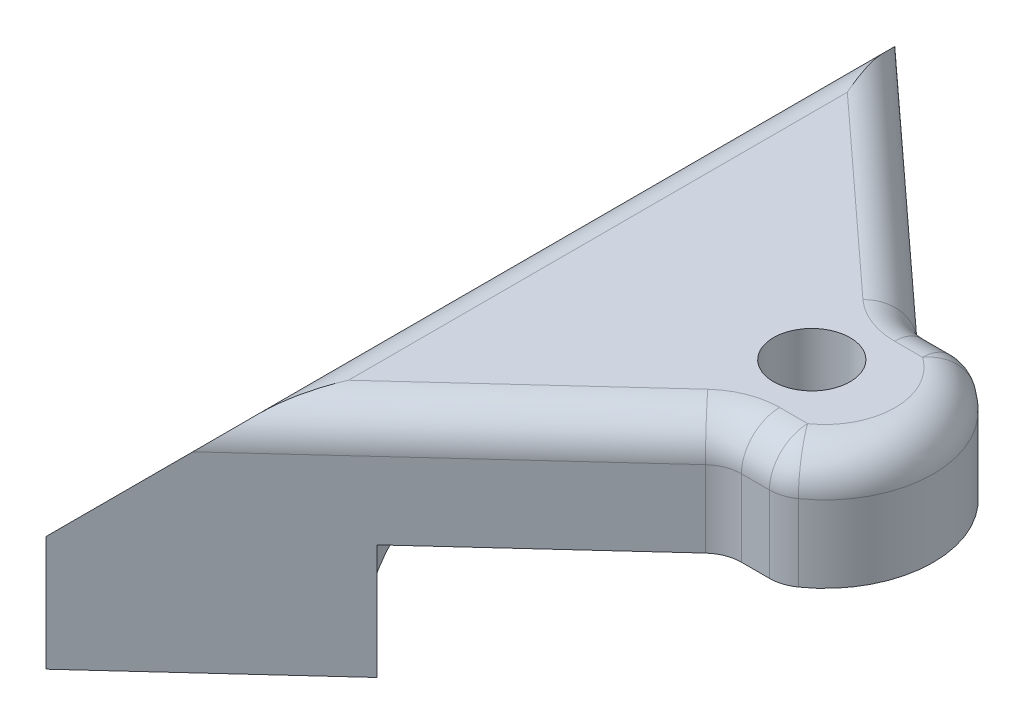
ISO-10303-21;
HEADER;
FILE_DESCRIPTION(('STEP AP214'),'2;1');
FILE_NAME('part.step','',(''),(''),'','','');
FILE_SCHEMA(('AUTOMOTIVE_DESIGN { 1 0 10303 214 1 1 1 1 }'));
ENDSEC;
DATA;
#1=APPLICATION_CONTEXT('core data for automotive mechanical design processes');
#2=APPLICATION_PROTOCOL_DEFINITION('international standard','automotive_design',2000,#1);
#3=PRODUCT_CONTEXT('',#1,'mechanical');
#4=PRODUCT('Part','Part','',(#3));
#5=PRODUCT_RELATED_PRODUCT_CATEGORY('part','',(#4));
#6=PRODUCT_DEFINITION_FORMATION('','',#4);
#7=PRODUCT_DEFINITION_CONTEXT('part definition',#1,'design');
#8=PRODUCT_DEFINITION('design','',#6,#7);
#9=PRODUCT_DEFINITION_SHAPE('','',#8);
#10=(LENGTH_UNIT() NAMED_UNIT(*) SI_UNIT(.MILLI.,.METRE.));
#11=(NAMED_UNIT(*) PLANE_ANGLE_UNIT() SI_UNIT($,.RADIAN.));
#12=(NAMED_UNIT(*) SI_UNIT($,.STERADIAN.) SOLID_ANGLE_UNIT());
#13=UNCERTAINTY_MEASURE_WITH_UNIT(LENGTH_MEASURE(1.E-05),#10,'distance_accuracy_value','');
#14=(GEOMETRIC_REPRESENTATION_CONTEXT(3) GLOBAL_UNCERTAINTY_ASSIGNED_CONTEXT((#13)) GLOBAL_UNIT_ASSIGNED_CONTEXT((#10,
#11,#12)) REPRESENTATION_CONTEXT('',''));
#15=CARTESIAN_POINT('',(0.,0.,0.));
#16=DIRECTION('',(0.,0.,1.));
#17=DIRECTION('',(1.,0.,0.));
#18=AXIS2_PLACEMENT_3D('',#15,#16,#17);
#19=CARTESIAN_POINT('',(0.,0.,0.));
#20=DIRECTION('',(0.,1.,0.));
#21=DIRECTION('',(0.,0.,1.));
#22=AXIS2_PLACEMENT_3D('',#19,#20,#21);
#23=PLANE('',#22);
#24=DIRECTION('',(1.,0.,0.));
#25=VECTOR('',#24,1.);
#26=CARTESIAN_POINT('',(0.,0.,-32.1575870971504));
#27=LINE('',#26,#25);
#28=CARTESIAN_POINT('',(9.49999999999998,0.,-32.1575870971504));
#29=VERTEX_POINT('',#28);
#30=CARTESIAN_POINT('',(30.5,0.,-32.1575870971504));
#31=VERTEX_POINT('',#30);
#32=EDGE_CURVE('E308',#29,#31,#27,.T.);
#33=ORIENTED_EDGE('',*,*,#32,.F.);
#34=DIRECTION('',(0.,0.,-1.));
#35=VECTOR('',#34,1.);
#36=CARTESIAN_POINT('',(9.49999999999998,0.,0.));
#37=LINE('',#36,#35);
#38=CARTESIAN_POINT('',(9.49999999999998,0.,-24.1575870971504));
#39=VERTEX_POINT('',#38);
#40=EDGE_CURVE('E273',#39,#29,#37,.T.);
#41=ORIENTED_EDGE('',*,*,#40,.F.);
#42=DIRECTION('',(-1.,0.,0.));
#43=VECTOR('',#42,1.);
#44=CARTESIAN_POINT('',(0.,0.,-24.1575870971504));
#45=LINE('',#44,#43);
#46=CARTESIAN_POINT('',(30.5,0.,-24.1575870971504));
#47=VERTEX_POINT('',#46);
#48=EDGE_CURVE('E282',#47,#39,#45,.T.);
#49=ORIENTED_EDGE('',*,*,#48,.F.);
#50=DIRECTION('',(0.,0.,-1.));
#51=VECTOR('',#50,1.);
#52=CARTESIAN_POINT('',(30.5,0.,0.));
#53=LINE('',#52,#51);
#54=CARTESIAN_POINT('',(30.5,0.,-19.6575870971504));
#55=VERTEX_POINT('',#54);
#56=EDGE_CURVE('E317',#55,#47,#53,.T.);
#57=ORIENTED_EDGE('',*,*,#56,.F.);
#58=DIRECTION('',(1.,0.,0.));
#59=VECTOR('',#58,1.);
#60=CARTESIAN_POINT('',(0.,0.,-19.6575870971504));
#61=LINE('',#60,#59);
#62=CARTESIAN_POINT('',(47.5,0.,-19.6575870971504));
#63=VERTEX_POINT('',#62);
#64=EDGE_CURVE('E325',#55,#63,#61,.T.);
#65=ORIENTED_EDGE('',*,*,#64,.T.);
#66=DIRECTION('',(0.,0.,-1.));
#67=VECTOR('',#66,1.);
#68=CARTESIAN_POINT('',(47.5,0.,0.));
#69=LINE('',#68,#67);
#70=CARTESIAN_POINT('',(47.5,0.,-36.6575870971504));
#71=VERTEX_POINT('',#70);
#72=EDGE_CURVE('E321',#63,#71,#69,.T.);
#73=ORIENTED_EDGE('',*,*,#72,.T.);
#74=DIRECTION('',(1.,0.,0.));
#75=VECTOR('',#74,1.);
#76=CARTESIAN_POINT('',(0.,0.,-36.6575870971504));
#77=LINE('',#76,#75);
#78=CARTESIAN_POINT('',(30.5,0.,-36.6575870971504));
#79=VERTEX_POINT('',#78);
#80=EDGE_CURVE('E316',#79,#71,#77,.T.);
#81=ORIENTED_EDGE('',*,*,#80,.F.);
#82=EDGE_CURVE('E312',#31,#79,#53,.T.);
#83=ORIENTED_EDGE('',*,*,#82,.F.);
#84=EDGE_LOOP('',(#33,#41,#49,#57,#65,#73,#81,#83));
#85=FACE_BOUND('',#84,.T.);
#86=DIRECTION('',(1.,0.,0.));
#87=VECTOR('',#86,1.);
#88=CARTESIAN_POINT('',(0.,0.,-40.6575870971504));
#89=LINE('',#88,#87);
#90=CARTESIAN_POINT('',(42.3085548164089,0.,-40.6575870971504));
#91=VERTEX_POINT('',#90);
#92=CARTESIAN_POINT('',(45.9674324639169,0.,-40.6575870971504));
#93=VERTEX_POINT('',#92);
#94=EDGE_CURVE('E360',#91,#93,#89,.T.);
#95=ORIENTED_EDGE('',*,*,#94,.T.);
#96=CARTESIAN_POINT('',(45.9674324639169,0.,-35.6575870971504));
#97=DIRECTION('',(0.,1.,0.));
#98=DIRECTION('',(0.,0.,1.));
#99=AXIS2_PLACEMENT_3D('',#96,#97,#98);
#100=CIRCLE('',#99,5.);
#101=CARTESIAN_POINT('',(48.8422303367973,0.,-39.7484961880595));
#102=VERTEX_POINT('',#101);
#103=EDGE_CURVE('E469',#93,#102,#100,.F.);
#104=ORIENTED_EDGE('',*,*,#103,.T.);
#105=CARTESIAN_POINT('',(40.6969696969696,0.,-28.1575870971504));
#106=DIRECTION('',(0.,1.,0.));
#107=DIRECTION('',(0.,0.,1.));
#108=AXIS2_PLACEMENT_3D('',#105,#106,#107);
#109=CIRCLE('',#108,14.1666666666667);
#110=CARTESIAN_POINT('',(48.8422303367973,0.,-16.5666780062413));
#111=VERTEX_POINT('',#110);
#112=EDGE_CURVE('E335',#102,#111,#109,.F.);
#113=ORIENTED_EDGE('',*,*,#112,.T.);
#114=CARTESIAN_POINT('',(45.9674324639169,0.,-20.6575870971504));
#115=DIRECTION('',(0.,1.,0.));
#116=DIRECTION('',(0.,0.,1.));
#117=AXIS2_PLACEMENT_3D('',#114,#115,#116);
#118=CIRCLE('',#117,5.);
#119=CARTESIAN_POINT('',(45.9674324639169,0.,-15.6575870971504));
#120=VERTEX_POINT('',#119);
#121=EDGE_CURVE('E466',#111,#120,#118,.F.);
#122=ORIENTED_EDGE('',*,*,#121,.T.);
#123=DIRECTION('',(-1.,0.,0.));
#124=VECTOR('',#123,1.);
#125=CARTESIAN_POINT('',(0.,0.,-15.6575870971504));
#126=LINE('',#125,#124);
#127=CARTESIAN_POINT('',(42.3085548164089,0.,-15.6575870971504));
#128=VERTEX_POINT('',#127);
#129=EDGE_CURVE('E232',#120,#128,#126,.T.);
#130=ORIENTED_EDGE('',*,*,#129,.T.);
#131=CARTESIAN_POINT('',(42.3085548164089,0.,-10.6575870971504));
#132=DIRECTION('',(0.,1.,0.));
#133=DIRECTION('',(0.,0.,1.));
#134=AXIS2_PLACEMENT_3D('',#131,#132,#133);
#135=CIRCLE('',#134,5.);
#136=CARTESIAN_POINT('',(38.9299316738222,0.,-14.3433577981541));
#137=VERTEX_POINT('',#136);
#138=EDGE_CURVE('E55',#128,#137,#135,.T.);
#139=ORIENTED_EDGE('',*,*,#138,.T.);
#140=DIRECTION('',(0.737154140200741,0.,-0.675724628517347));
#141=VECTOR('',#140,1.);
#142=CARTESIAN_POINT('',(10.6309377478345,0.,11.5973866340013));
#143=LINE('',#142,#141);
#144=CARTESIAN_POINT('',(16.5638592524006,0.,6.15887525481573));
#145=VERTEX_POINT('',#144);
#146=EDGE_CURVE('E367',#145,#137,#143,.T.);
#147=ORIENTED_EDGE('',*,*,#146,.F.);
#148=CARTESIAN_POINT('',(39.,0.,-28.1575870971504));
#149=DIRECTION('',(0.,1.,0.));
#150=DIRECTION('',(0.,0.,-1.));
#151=AXIS2_PLACEMENT_3D('',#148,#149,#150);
#152=CIRCLE('',#151,41.);
#153=CARTESIAN_POINT('',(16.5638592524006,0.,-62.4740494491165));
#154=VERTEX_POINT('',#153);
#155=EDGE_CURVE('E248',#154,#145,#152,.T.);
#156=ORIENTED_EDGE('',*,*,#155,.F.);
#157=DIRECTION('',(-0.737154140200741,0.,-0.675724628517347));
#158=VECTOR('',#157,1.);
#159=CARTESIAN_POINT('',(38.6822697993353,0.,-42.198839781093));
#160=LINE('',#159,#158);
#161=CARTESIAN_POINT('',(38.9299316738222,0.,-41.9718163961467));
#162=VERTEX_POINT('',#161);
#163=EDGE_CURVE('E364',#162,#154,#160,.T.);
#164=ORIENTED_EDGE('',*,*,#163,.F.);
#165=CARTESIAN_POINT('',(42.3085548164089,0.,-45.6575870971504));
#166=DIRECTION('',(0.,1.,0.));
#167=DIRECTION('',(0.,0.,1.));
#168=AXIS2_PLACEMENT_3D('',#165,#166,#167);
#169=CIRCLE('',#168,5.);
#170=EDGE_CURVE('E11',#162,#91,#169,.T.);
#171=ORIENTED_EDGE('',*,*,#170,.T.);
#172=EDGE_LOOP('',(#95,#104,#113,#122,#130,#139,#147,#156,#164,#171));
#173=FACE_BOUND('',#172,.T.);
#174=ADVANCED_FACE('F45',(#85,#173),#23,.F.);
#175=CARTESIAN_POINT('',(40.6969696969696,15.,-28.1575870971504));
#176=DIRECTION('',(0.,-1.,0.));
#177=DIRECTION('',(0.,0.,-1.));
#178=AXIS2_PLACEMENT_3D('',#175,#176,#177);
#179=CYLINDRICAL_SURFACE('',#178,14.1666666666667);
#180=ORIENTED_EDGE('',*,*,#112,.F.);
#181=DIRECTION('',(0.,-1.,0.));
#182=VECTOR('',#181,1.);
#183=CARTESIAN_POINT('',(48.8422303367973,15.,-39.7484961880595));
#184=LINE('',#183,#182);
#185=CARTESIAN_POINT('',(48.8422303367973,10.,-39.7484961880595));
#186=VERTEX_POINT('',#185);
#187=EDGE_CURVE('E435',#102,#186,#184,.F.);
#188=ORIENTED_EDGE('',*,*,#187,.T.);
#189=CARTESIAN_POINT('',(40.6969696969696,10.,-28.1575870971504));
#190=DIRECTION('',(0.,1.,0.));
#191=DIRECTION('',(0.,0.,1.));
#192=AXIS2_PLACEMENT_3D('',#189,#190,#191);
#193=CIRCLE('',#192,14.1666666666667);
#194=CARTESIAN_POINT('',(48.8422303367973,10.,-16.5666780062413));
#195=VERTEX_POINT('',#194);
#196=EDGE_CURVE('E432',#186,#195,#193,.F.);
#197=ORIENTED_EDGE('',*,*,#196,.T.);
#198=DIRECTION('',(0.,-1.,0.));
#199=VECTOR('',#198,1.);
#200=CARTESIAN_POINT('',(48.8422303367973,15.,-16.5666780062413));
#201=LINE('',#200,#199);
#202=EDGE_CURVE('E429',#195,#111,#201,.T.);
#203=ORIENTED_EDGE('',*,*,#202,.T.);
#204=EDGE_LOOP('',(#180,#188,#197,#203));
#205=FACE_BOUND('',#204,.T.);
#206=ADVANCED_FACE('F560',(#205),#179,.T.);
#207=CARTESIAN_POINT('',(0.,15.,-40.6575870971504));
#208=DIRECTION('',(0.,0.,-1.));
#209=DIRECTION('',(-1.,0.,0.));
#210=AXIS2_PLACEMENT_3D('',#207,#208,#209);
#211=PLANE('',#210);
#212=ORIENTED_EDGE('',*,*,#94,.F.);
#213=DIRECTION('',(0.,-1.,0.));
#214=VECTOR('',#213,1.);
#215=CARTESIAN_POINT('',(42.3085548164089,15.,-40.6575870971504));
#216=LINE('',#215,#214);
#217=CARTESIAN_POINT('',(42.3085548164089,10.,-40.6575870971504));
#218=VERTEX_POINT('',#217);
#219=EDGE_CURVE('E68',#91,#218,#216,.F.);
#220=ORIENTED_EDGE('',*,*,#219,.T.);
#221=DIRECTION('',(1.,0.,0.));
#222=VECTOR('',#221,1.);
#223=CARTESIAN_POINT('',(0.,10.,-40.6575870971504));
#224=LINE('',#223,#222);
#225=CARTESIAN_POINT('',(45.9674324639169,10.,-40.6575870971504));
#226=VERTEX_POINT('',#225);
#227=EDGE_CURVE('E63',#218,#226,#224,.T.);
#228=ORIENTED_EDGE('',*,*,#227,.T.);
#229=DIRECTION('',(0.,-1.,0.));
#230=VECTOR('',#229,1.);
#231=CARTESIAN_POINT('',(45.9674324639169,15.,-40.6575870971504));
#232=LINE('',#231,#230);
#233=EDGE_CURVE('E461',#226,#93,#232,.T.);
#234=ORIENTED_EDGE('',*,*,#233,.T.);
#235=EDGE_LOOP('',(#212,#220,#228,#234));
#236=FACE_BOUND('',#235,.T.);
#237=ADVANCED_FACE('F555',(#236),#211,.T.);
#238=CARTESIAN_POINT('',(38.6822697993353,15.,-42.198839781093));
#239=DIRECTION('',(-0.675724628517346,0.,0.737154140200741));
#240=DIRECTION('',(0.737154140200741,0.,0.675724628517347));
#241=AXIS2_PLACEMENT_3D('',#238,#239,#240);
#242=PLANE('',#241);
#243=DIRECTION('',(-0.737154140200741,0.,-0.675724628517347));
#244=VECTOR('',#243,1.);
#245=CARTESIAN_POINT('',(40.3636363636363,10.,-40.6575870971504));
#246=LINE('',#245,#244);
#247=CARTESIAN_POINT('',(4.00000000000001,10.,-73.9909204304837));
#248=VERTEX_POINT('',#247);
#249=CARTESIAN_POINT('',(38.9299316738222,10.,-41.9718163961467));
#250=VERTEX_POINT('',#249);
#251=EDGE_CURVE('E453',#248,#250,#246,.F.);
#252=ORIENTED_EDGE('',*,*,#251,.T.);
#253=DIRECTION('',(0.,-1.,0.));
#254=VECTOR('',#253,1.);
#255=CARTESIAN_POINT('',(38.9299316738222,15.,-41.9718163961467));
#256=LINE('',#255,#254);
#257=EDGE_CURVE('E456',#250,#162,#256,.T.);
#258=ORIENTED_EDGE('',*,*,#257,.T.);
#259=ORIENTED_EDGE('',*,*,#163,.T.);
#260=DIRECTION('',(0.,1.,0.));
#261=VECTOR('',#260,1.);
#262=CARTESIAN_POINT('',(16.5638592524006,-15.,-62.4740494491165));
#263=LINE('',#262,#261);
#264=CARTESIAN_POINT('',(16.5638592524006,-15.,-62.4740494491165));
#265=VERTEX_POINT('',#264);
#266=EDGE_CURVE('E264',#265,#154,#263,.T.);
#267=ORIENTED_EDGE('',*,*,#266,.F.);
#268=DIRECTION('',(0.737154140200741,0.,0.675724628517346));
#269=VECTOR('',#268,1.);
#270=CARTESIAN_POINT('',(-6.00000000000001,-15.,-83.1575870971504));
#271=LINE('',#270,#269);
#272=CARTESIAN_POINT('',(-6.00000000000001,-15.,-83.1575870971504));
#273=VERTEX_POINT('',#272);
#274=EDGE_CURVE('E241',#273,#265,#271,.T.);
#275=ORIENTED_EDGE('',*,*,#274,.F.);
#276=DIRECTION('',(0.,-1.,0.));
#277=VECTOR('',#276,1.);
#278=CARTESIAN_POINT('',(-6.00000000000001,15.,-83.1575870971504));
#279=LINE('',#278,#277);
#280=CARTESIAN_POINT('',(-6.00000000000001,0.,-83.1575870971504));
#281=VERTEX_POINT('',#280);
#282=EDGE_CURVE('E231',#281,#273,#279,.T.);
#283=ORIENTED_EDGE('',*,*,#282,.F.);
#284=DIRECTION('',(0.593361811720978,0.59336181172098,0.543914994077563));
#285=VECTOR('',#284,1.);
#286=CARTESIAN_POINT('',(31.400492657271,37.4004926572711,-48.8738021613187));
#287=LINE('',#286,#285);
#288=EDGE_CURVE('E388',#281,#248,#287,.T.);
#289=ORIENTED_EDGE('',*,*,#288,.T.);
#290=EDGE_LOOP('',(#252,#258,#259,#267,#275,#283,#289));
#291=FACE_BOUND('',#290,.T.);
#292=ADVANCED_FACE('F546',(#291),#242,.F.);
#293=CARTESIAN_POINT('',(-6.,15.,0.));
#294=DIRECTION('',(1.,0.,0.));
#295=DIRECTION('',(0.,0.,-1.));
#296=AXIS2_PLACEMENT_3D('',#293,#294,#295);
#297=PLANE('',#296);
#298=CARTESIAN_POINT('',(-6.,-8.,-3.15758709715041));
#299=DIRECTION('',(1.,0.,0.));
#300=DIRECTION('',(0.,0.,-1.));
#301=AXIS2_PLACEMENT_3D('',#298,#299,#300);
#302=CIRCLE('',#301,3.5);
#303=CARTESIAN_POINT('',(-6.,-8.,-6.65758709715041));
#304=VERTEX_POINT('',#303);
#305=EDGE_CURVE('E379',#304,#304,#302,.F.);
#306=ORIENTED_EDGE('',*,*,#305,.F.);
#307=EDGE_LOOP('',(#306));
#308=FACE_BOUND('',#307,.T.);
#309=CARTESIAN_POINT('',(-6.00000000000001,-8.,-53.1575870971504));
#310=DIRECTION('',(1.,0.,0.));
#311=DIRECTION('',(0.,0.,-1.));
#312=AXIS2_PLACEMENT_3D('',#309,#310,#311);
#313=CIRCLE('',#312,3.5);
#314=CARTESIAN_POINT('',(-6.00000000000001,-8.,-56.6575870971504));
#315=VERTEX_POINT('',#314);
#316=EDGE_CURVE('E375',#315,#315,#313,.F.);
#317=ORIENTED_EDGE('',*,*,#316,.F.);
#318=EDGE_LOOP('',(#317));
#319=FACE_BOUND('',#318,.T.);
#320=DIRECTION('',(0.,-1.,0.));
#321=VECTOR('',#320,1.);
#322=CARTESIAN_POINT('',(-6.,15.,26.8424129028496));
#323=LINE('',#322,#321);
#324=CARTESIAN_POINT('',(-6.,0.,26.8424129028496));
#325=VERTEX_POINT('',#324);
#326=CARTESIAN_POINT('',(-6.,-15.,26.8424129028496));
#327=VERTEX_POINT('',#326);
#328=EDGE_CURVE('E219',#325,#327,#323,.T.);
#329=ORIENTED_EDGE('',*,*,#328,.F.);
#330=DIRECTION('',(0.,0.,-1.));
#331=VECTOR('',#330,1.);
#332=CARTESIAN_POINT('',(-6.00000000000001,0.,-83.1575870971504));
#333=LINE('',#332,#331);
#334=EDGE_CURVE('E385',#325,#281,#333,.T.);
#335=ORIENTED_EDGE('',*,*,#334,.T.);
#336=ORIENTED_EDGE('',*,*,#282,.T.);
#337=DIRECTION('',(0.,0.,-1.));
#338=VECTOR('',#337,1.);
#339=CARTESIAN_POINT('',(-6.,-15.,26.8424129028496));
#340=LINE('',#339,#338);
#341=EDGE_CURVE('E235',#327,#273,#340,.T.);
#342=ORIENTED_EDGE('',*,*,#341,.F.);
#343=EDGE_LOOP('',(#329,#335,#336,#342));
#344=FACE_BOUND('',#343,.T.);
#345=ADVANCED_FACE('F236',(#308,#319,#344),#297,.F.);
#346=CARTESIAN_POINT('',(10.6309377478345,15.,11.5973866340013));
#347=DIRECTION('',(-0.675724628517347,0.,-0.737154140200741));
#348=DIRECTION('',(-0.737154140200741,0.,0.675724628517347));
#349=AXIS2_PLACEMENT_3D('',#346,#347,#348);
#350=PLANE('',#349);
#351=ORIENTED_EDGE('',*,*,#146,.T.);
#352=DIRECTION('',(0.,-1.,0.));
#353=VECTOR('',#352,1.);
#354=CARTESIAN_POINT('',(38.9299316738222,15.,-14.3433577981541));
#355=LINE('',#354,#353);
#356=CARTESIAN_POINT('',(38.9299316738222,10.,-14.3433577981541));
#357=VERTEX_POINT('',#356);
#358=EDGE_CURVE('E450',#137,#357,#355,.F.);
#359=ORIENTED_EDGE('',*,*,#358,.T.);
#360=DIRECTION('',(0.737154140200741,0.,-0.675724628517347));
#361=VECTOR('',#360,1.);
#362=CARTESIAN_POINT('',(9.,10.,13.0924129028496));
#363=LINE('',#362,#361);
#364=CARTESIAN_POINT('',(4.00000000000001,10.,17.6757462361829));
#365=VERTEX_POINT('',#364);
#366=EDGE_CURVE('E447',#357,#365,#363,.F.);
#367=ORIENTED_EDGE('',*,*,#366,.T.);
#368=DIRECTION('',(-0.593361811720978,-0.59336181172098,0.543914994077563));
#369=VECTOR('',#368,1.);
#370=CARTESIAN_POINT('',(13.2254242131446,19.2254242131446,9.2191073741337));
#371=LINE('',#370,#369);
#372=EDGE_CURVE('E227',#365,#325,#371,.T.);
#373=ORIENTED_EDGE('',*,*,#372,.T.);
#374=ORIENTED_EDGE('',*,*,#328,.T.);
#375=DIRECTION('',(-0.737154140200741,0.,0.675724628517346));
#376=VECTOR('',#375,1.);
#377=CARTESIAN_POINT('',(-6.,-15.,26.8424129028496));
#378=LINE('',#377,#376);
#379=CARTESIAN_POINT('',(16.5638592524006,-15.,6.15887525481573));
#380=VERTEX_POINT('',#379);
#381=EDGE_CURVE('E225',#380,#327,#378,.T.);
#382=ORIENTED_EDGE('',*,*,#381,.F.);
#383=DIRECTION('',(0.,1.,0.));
#384=VECTOR('',#383,1.);
#385=CARTESIAN_POINT('',(16.5638592524006,-15.,6.15887525481573));
#386=LINE('',#385,#384);
#387=EDGE_CURVE('E260',#380,#145,#386,.T.);
#388=ORIENTED_EDGE('',*,*,#387,.T.);
#389=EDGE_LOOP('',(#351,#359,#367,#373,#374,#382,#388));
#390=FACE_BOUND('',#389,.T.);
#391=ADVANCED_FACE('F222',(#390),#350,.F.);
#392=CARTESIAN_POINT('',(0.,15.,-15.6575870971504));
#393=DIRECTION('',(0.,0.,1.));
#394=DIRECTION('',(1.,0.,0.));
#395=AXIS2_PLACEMENT_3D('',#392,#393,#394);
#396=PLANE('',#395);
#397=DIRECTION('',(-1.,0.,0.));
#398=VECTOR('',#397,1.);
#399=CARTESIAN_POINT('',(0.,10.,-15.6575870971504));
#400=LINE('',#399,#398);
#401=CARTESIAN_POINT('',(45.9674324639169,10.,-15.6575870971504));
#402=VERTEX_POINT('',#401);
#403=CARTESIAN_POINT('',(42.3085548164089,10.,-15.6575870971504));
#404=VERTEX_POINT('',#403);
#405=EDGE_CURVE('E438',#402,#404,#400,.T.);
#406=ORIENTED_EDGE('',*,*,#405,.T.);
#407=DIRECTION('',(0.,-1.,0.));
#408=VECTOR('',#407,1.);
#409=CARTESIAN_POINT('',(42.3085548164089,15.,-15.6575870971504));
#410=LINE('',#409,#408);
#411=EDGE_CURVE('E444',#404,#128,#410,.T.);
#412=ORIENTED_EDGE('',*,*,#411,.T.);
#413=ORIENTED_EDGE('',*,*,#129,.F.);
#414=DIRECTION('',(0.,-1.,0.));
#415=VECTOR('',#414,1.);
#416=CARTESIAN_POINT('',(45.9674324639169,15.,-15.6575870971504));
#417=LINE('',#416,#415);
#418=EDGE_CURVE('E441',#120,#402,#417,.F.);
#419=ORIENTED_EDGE('',*,*,#418,.T.);
#420=EDGE_LOOP('',(#406,#412,#413,#419));
#421=FACE_BOUND('',#420,.T.);
#422=ADVANCED_FACE('F553',(#421),#396,.T.);
#423=CARTESIAN_POINT('',(0.,15.,0.));
#424=DIRECTION('',(0.,1.,0.));
#425=DIRECTION('',(0.,0.,1.));
#426=AXIS2_PLACEMENT_3D('',#423,#424,#425);
#427=PLANE('',#426);
#428=CARTESIAN_POINT('',(40.6969696969696,15.,-28.1575870971504));
#429=DIRECTION('',(0.,1.,0.));
#430=DIRECTION('',(0.,0.,1.));
#431=AXIS2_PLACEMENT_3D('',#428,#429,#430);
#432=CIRCLE('',#431,9.16666666666668);
#433=CARTESIAN_POINT('',(45.9674324639169,15.,-20.6575870971504));
#434=VERTEX_POINT('',#433);
#435=CARTESIAN_POINT('',(45.9674324639169,15.,-35.6575870971504));
#436=VERTEX_POINT('',#435);
#437=EDGE_CURVE('E402',#434,#436,#432,.T.);
#438=ORIENTED_EDGE('',*,*,#437,.T.);
#439=DIRECTION('',(1.,0.,0.));
#440=VECTOR('',#439,1.);
#441=CARTESIAN_POINT('',(0.,15.,-35.6575870971504));
#442=LINE('',#441,#440);
#443=CARTESIAN_POINT('',(42.3085548164089,15.,-35.6575870971504));
#444=VERTEX_POINT('',#443);
#445=EDGE_CURVE('E416',#436,#444,#442,.F.);
#446=ORIENTED_EDGE('',*,*,#445,.T.);
#447=CARTESIAN_POINT('',(42.3085548164089,15.,-45.6575870971504));
#448=DIRECTION('',(0.,1.,0.));
#449=DIRECTION('',(0.,0.,1.));
#450=AXIS2_PLACEMENT_3D('',#447,#448,#449);
#451=CIRCLE('',#450,10.);
#452=CARTESIAN_POINT('',(35.5513085312354,15.,-38.286045695143));
#453=VERTEX_POINT('',#452);
#454=EDGE_CURVE('E412',#453,#444,#451,.T.);
#455=ORIENTED_EDGE('',*,*,#454,.F.);
#456=DIRECTION('',(-0.737154140200741,0.,-0.675724628517347));
#457=VECTOR('',#456,1.);
#458=CARTESIAN_POINT('',(5.62137685741324,15.,-65.7218163961467));
#459=LINE('',#458,#457);
#460=CARTESIAN_POINT('',(11.0710678118655,15.,-60.7262663545655));
#461=VERTEX_POINT('',#460);
#462=EDGE_CURVE('E409',#453,#461,#459,.T.);
#463=ORIENTED_EDGE('',*,*,#462,.T.);
#464=DIRECTION('',(0.,0.,1.));
#465=VECTOR('',#464,1.);
#466=CARTESIAN_POINT('',(11.0710678118655,15.,0.));
#467=LINE('',#466,#465);
#468=CARTESIAN_POINT('',(11.0710678118655,15.,4.41109216026468));
#469=VERTEX_POINT('',#468);
#470=EDGE_CURVE('E405',#461,#469,#467,.T.);
#471=ORIENTED_EDGE('',*,*,#470,.T.);
#472=DIRECTION('',(0.737154140200741,0.,-0.675724628517347));
#473=VECTOR('',#472,1.);
#474=CARTESIAN_POINT('',(36.9850132210496,15.,-19.3433577981541));
#475=LINE('',#474,#473);
#476=CARTESIAN_POINT('',(35.5513085312354,15.,-18.0291284991578));
#477=VERTEX_POINT('',#476);
#478=EDGE_CURVE('E396',#469,#477,#475,.T.);
#479=ORIENTED_EDGE('',*,*,#478,.T.);
#480=CARTESIAN_POINT('',(42.3085548164089,15.,-10.6575870971504));
#481=DIRECTION('',(0.,1.,0.));
#482=DIRECTION('',(0.,0.,1.));
#483=AXIS2_PLACEMENT_3D('',#480,#481,#482);
#484=CIRCLE('',#483,10.);
#485=CARTESIAN_POINT('',(42.3085548164089,15.,-20.6575870971504));
#486=VERTEX_POINT('',#485);
#487=EDGE_CURVE('E392',#486,#477,#484,.T.);
#488=ORIENTED_EDGE('',*,*,#487,.F.);
#489=DIRECTION('',(-1.,0.,0.));
#490=VECTOR('',#489,1.);
#491=CARTESIAN_POINT('',(0.,15.,-20.6575870971504));
#492=LINE('',#491,#490);
#493=EDGE_CURVE('E399',#486,#434,#492,.F.);
#494=ORIENTED_EDGE('',*,*,#493,.T.);
#495=EDGE_LOOP('',(#438,#446,#455,#463,#471,#479,#488,#494));
#496=FACE_BOUND('',#495,.T.);
#497=CARTESIAN_POINT('',(39.,15.,-28.1575870971504));
#498=DIRECTION('',(0.,1.,0.));
#499=DIRECTION('',(0.,0.,1.));
#500=AXIS2_PLACEMENT_3D('',#497,#498,#499);
#501=CIRCLE('',#500,4.99999999999999);
#502=CARTESIAN_POINT('',(39.,15.,-23.1575870971504));
#503=VERTEX_POINT('',#502);
#504=EDGE_CURVE('E269',#503,#503,#501,.T.);
#505=ORIENTED_EDGE('',*,*,#504,.F.);
#506=EDGE_LOOP('',(#505));
#507=FACE_BOUND('',#506,.T.);
#508=ADVANCED_FACE('F572',(#496,#507),#427,.T.);
#509=CARTESIAN_POINT('',(9.49999999999998,6.,0.));
#510=DIRECTION('',(-1.,0.,0.));
#511=DIRECTION('',(0.,0.,1.));
#512=AXIS2_PLACEMENT_3D('',#509,#510,#511);
#513=PLANE('',#512);
#514=ORIENTED_EDGE('',*,*,#40,.T.);
#515=DIRECTION('',(0.,-1.,0.));
#516=VECTOR('',#515,1.);
#517=CARTESIAN_POINT('',(9.49999999999998,6.,-32.1575870971504));
#518=LINE('',#517,#516);
#519=CARTESIAN_POINT('',(9.49999999999998,6.,-32.1575870971504));
#520=VERTEX_POINT('',#519);
#521=EDGE_CURVE('E305',#520,#29,#518,.T.);
#522=ORIENTED_EDGE('',*,*,#521,.F.);
#523=DIRECTION('',(0.,0.,-1.));
#524=VECTOR('',#523,1.);
#525=CARTESIAN_POINT('',(9.49999999999998,6.,0.));
#526=LINE('',#525,#524);
#527=CARTESIAN_POINT('',(9.49999999999998,6.,-24.1575870971504));
#528=VERTEX_POINT('',#527);
#529=EDGE_CURVE('E277',#528,#520,#526,.T.);
#530=ORIENTED_EDGE('',*,*,#529,.F.);
#531=DIRECTION('',(0.,-1.,0.));
#532=VECTOR('',#531,1.);
#533=CARTESIAN_POINT('',(9.49999999999998,6.,-24.1575870971504));
#534=LINE('',#533,#532);
#535=EDGE_CURVE('E332',#528,#39,#534,.T.);
#536=ORIENTED_EDGE('',*,*,#535,.T.);
#537=EDGE_LOOP('',(#514,#522,#530,#536));
#538=FACE_BOUND('',#537,.T.);
#539=ADVANCED_FACE('F579',(#538),#513,.F.);
#540=CARTESIAN_POINT('',(0.,6.,-24.1575870971504));
#541=DIRECTION('',(0.,0.,1.));
#542=DIRECTION('',(1.,0.,0.));
#543=AXIS2_PLACEMENT_3D('',#540,#541,#542);
#544=PLANE('',#543);
#545=ORIENTED_EDGE('',*,*,#48,.T.);
#546=ORIENTED_EDGE('',*,*,#535,.F.);
#547=DIRECTION('',(-1.,0.,0.));
#548=VECTOR('',#547,1.);
#549=CARTESIAN_POINT('',(0.,6.,-24.1575870971504));
#550=LINE('',#549,#548);
#551=CARTESIAN_POINT('',(30.5,6.,-24.1575870971504));
#552=VERTEX_POINT('',#551);
#553=EDGE_CURVE('E301',#552,#528,#550,.T.);
#554=ORIENTED_EDGE('',*,*,#553,.F.);
#555=DIRECTION('',(0.,-1.,0.));
#556=VECTOR('',#555,1.);
#557=CARTESIAN_POINT('',(30.5,6.,-24.1575870971504));
#558=LINE('',#557,#556);
#559=EDGE_CURVE('E336',#552,#47,#558,.T.);
#560=ORIENTED_EDGE('',*,*,#559,.T.);
#561=EDGE_LOOP('',(#545,#546,#554,#560));
#562=FACE_BOUND('',#561,.T.);
#563=ADVANCED_FACE('F940',(#562),#544,.F.);
#564=CARTESIAN_POINT('',(30.5,6.,0.));
#565=DIRECTION('',(-1.,0.,0.));
#566=DIRECTION('',(0.,0.,1.));
#567=AXIS2_PLACEMENT_3D('',#564,#565,#566);
#568=PLANE('',#567);
#569=ORIENTED_EDGE('',*,*,#56,.T.);
#570=ORIENTED_EDGE('',*,*,#559,.F.);
#571=DIRECTION('',(0.,0.,-1.));
#572=VECTOR('',#571,1.);
#573=CARTESIAN_POINT('',(30.5,6.,0.));
#574=LINE('',#573,#572);
#575=CARTESIAN_POINT('',(30.5,6.,-19.6575870971504));
#576=VERTEX_POINT('',#575);
#577=EDGE_CURVE('E291',#576,#552,#574,.T.);
#578=ORIENTED_EDGE('',*,*,#577,.F.);
#579=DIRECTION('',(0.,-1.,0.));
#580=VECTOR('',#579,1.);
#581=CARTESIAN_POINT('',(30.5,6.,-19.6575870971504));
#582=LINE('',#581,#580);
#583=EDGE_CURVE('E339',#576,#55,#582,.T.);
#584=ORIENTED_EDGE('',*,*,#583,.T.);
#585=EDGE_LOOP('',(#569,#570,#578,#584));
#586=FACE_BOUND('',#585,.T.);
#587=ADVANCED_FACE('F903',(#586),#568,.F.);
#588=CARTESIAN_POINT('',(0.,6.,-19.6575870971504));
#589=DIRECTION('',(0.,0.,-1.));
#590=DIRECTION('',(-1.,0.,0.));
#591=AXIS2_PLACEMENT_3D('',#588,#589,#590);
#592=PLANE('',#591);
#593=ORIENTED_EDGE('',*,*,#64,.F.);
#594=ORIENTED_EDGE('',*,*,#583,.F.);
#595=DIRECTION('',(1.,0.,0.));
#596=VECTOR('',#595,1.);
#597=CARTESIAN_POINT('',(0.,6.,-19.6575870971504));
#598=LINE('',#597,#596);
#599=CARTESIAN_POINT('',(47.5,6.,-19.6575870971504));
#600=VERTEX_POINT('',#599);
#601=EDGE_CURVE('E298',#576,#600,#598,.T.);
#602=ORIENTED_EDGE('',*,*,#601,.T.);
#603=DIRECTION('',(0.,-1.,0.));
#604=VECTOR('',#603,1.);
#605=CARTESIAN_POINT('',(47.5,6.,-19.6575870971504));
#606=LINE('',#605,#604);
#607=EDGE_CURVE('E342',#600,#63,#606,.T.);
#608=ORIENTED_EDGE('',*,*,#607,.T.);
#609=EDGE_LOOP('',(#593,#594,#602,#608));
#610=FACE_BOUND('',#609,.T.);
#611=ADVANCED_FACE('F921',(#610),#592,.T.);
#612=CARTESIAN_POINT('',(47.5,6.,0.));
#613=DIRECTION('',(-1.,0.,0.));
#614=DIRECTION('',(0.,0.,1.));
#615=AXIS2_PLACEMENT_3D('',#612,#613,#614);
#616=PLANE('',#615);
#617=ORIENTED_EDGE('',*,*,#72,.F.);
#618=ORIENTED_EDGE('',*,*,#607,.F.);
#619=DIRECTION('',(0.,0.,-1.));
#620=VECTOR('',#619,1.);
#621=CARTESIAN_POINT('',(47.5,6.,0.));
#622=LINE('',#621,#620);
#623=CARTESIAN_POINT('',(47.5,6.,-36.6575870971504));
#624=VERTEX_POINT('',#623);
#625=EDGE_CURVE('E295',#600,#624,#622,.T.);
#626=ORIENTED_EDGE('',*,*,#625,.T.);
#627=DIRECTION('',(0.,-1.,0.));
#628=VECTOR('',#627,1.);
#629=CARTESIAN_POINT('',(47.5,6.,-36.6575870971504));
#630=LINE('',#629,#628);
#631=EDGE_CURVE('E345',#624,#71,#630,.T.);
#632=ORIENTED_EDGE('',*,*,#631,.T.);
#633=EDGE_LOOP('',(#617,#618,#626,#632));
#634=FACE_BOUND('',#633,.T.);
#635=ADVANCED_FACE('F911',(#634),#616,.T.);
#636=CARTESIAN_POINT('',(0.,6.,-36.6575870971504));
#637=DIRECTION('',(0.,0.,-1.));
#638=DIRECTION('',(-1.,0.,0.));
#639=AXIS2_PLACEMENT_3D('',#636,#637,#638);
#640=PLANE('',#639);
#641=ORIENTED_EDGE('',*,*,#80,.T.);
#642=ORIENTED_EDGE('',*,*,#631,.F.);
#643=DIRECTION('',(1.,0.,0.));
#644=VECTOR('',#643,1.);
#645=CARTESIAN_POINT('',(0.,6.,-36.6575870971504));
#646=LINE('',#645,#644);
#647=CARTESIAN_POINT('',(30.5,6.,-36.6575870971504));
#648=VERTEX_POINT('',#647);
#649=EDGE_CURVE('E290',#648,#624,#646,.T.);
#650=ORIENTED_EDGE('',*,*,#649,.F.);
#651=DIRECTION('',(0.,-1.,0.));
#652=VECTOR('',#651,1.);
#653=CARTESIAN_POINT('',(30.5,6.,-36.6575870971504));
#654=LINE('',#653,#652);
#655=EDGE_CURVE('E348',#648,#79,#654,.T.);
#656=ORIENTED_EDGE('',*,*,#655,.T.);
#657=EDGE_LOOP('',(#641,#642,#650,#656));
#658=FACE_BOUND('',#657,.T.);
#659=ADVANCED_FACE('F900',(#658),#640,.F.);
#660=ORIENTED_EDGE('',*,*,#82,.T.);
#661=ORIENTED_EDGE('',*,*,#655,.F.);
#662=CARTESIAN_POINT('',(30.5,6.,-32.1575870971504));
#663=VERTEX_POINT('',#662);
#664=EDGE_CURVE('E286',#663,#648,#574,.T.);
#665=ORIENTED_EDGE('',*,*,#664,.F.);
#666=DIRECTION('',(0.,-1.,0.));
#667=VECTOR('',#666,1.);
#668=CARTESIAN_POINT('',(30.5,6.,-32.1575870971504));
#669=LINE('',#668,#667);
#670=EDGE_CURVE('E351',#663,#31,#669,.T.);
#671=ORIENTED_EDGE('',*,*,#670,.T.);
#672=EDGE_LOOP('',(#660,#661,#665,#671));
#673=FACE_BOUND('',#672,.T.);
#674=ADVANCED_FACE('F889',(#673),#568,.F.);
#675=CARTESIAN_POINT('',(0.,6.,-32.1575870971504));
#676=DIRECTION('',(0.,0.,-1.));
#677=DIRECTION('',(-1.,0.,0.));
#678=AXIS2_PLACEMENT_3D('',#675,#676,#677);
#679=PLANE('',#678);
#680=ORIENTED_EDGE('',*,*,#32,.T.);
#681=ORIENTED_EDGE('',*,*,#670,.F.);
#682=DIRECTION('',(1.,0.,0.));
#683=VECTOR('',#682,1.);
#684=CARTESIAN_POINT('',(0.,6.,-32.1575870971504));
#685=LINE('',#684,#683);
#686=EDGE_CURVE('E281',#520,#663,#685,.T.);
#687=ORIENTED_EDGE('',*,*,#686,.F.);
#688=ORIENTED_EDGE('',*,*,#521,.T.);
#689=EDGE_LOOP('',(#680,#681,#687,#688));
#690=FACE_BOUND('',#689,.T.);
#691=ADVANCED_FACE('F876',(#690),#679,.F.);
#692=CARTESIAN_POINT('',(0.,6.,0.));
#693=DIRECTION('',(0.,-1.,0.));
#694=DIRECTION('',(0.,0.,-1.));
#695=AXIS2_PLACEMENT_3D('',#692,#693,#694);
#696=PLANE('',#695);
#697=CARTESIAN_POINT('',(39.,6.,-28.1575870971504));
#698=DIRECTION('',(0.,1.,0.));
#699=DIRECTION('',(0.,0.,1.));
#700=AXIS2_PLACEMENT_3D('',#697,#698,#699);
#701=CIRCLE('',#700,4.99999999999999);
#702=CARTESIAN_POINT('',(39.,6.,-23.1575870971504));
#703=VERTEX_POINT('',#702);
#704=EDGE_CURVE('E268',#703,#703,#701,.T.);
#705=ORIENTED_EDGE('',*,*,#704,.T.);
#706=EDGE_LOOP('',(#705));
#707=FACE_BOUND('',#706,.T.);
#708=ORIENTED_EDGE('',*,*,#529,.T.);
#709=ORIENTED_EDGE('',*,*,#686,.T.);
#710=ORIENTED_EDGE('',*,*,#664,.T.);
#711=ORIENTED_EDGE('',*,*,#649,.T.);
#712=ORIENTED_EDGE('',*,*,#625,.F.);
#713=ORIENTED_EDGE('',*,*,#601,.F.);
#714=ORIENTED_EDGE('',*,*,#577,.T.);
#715=ORIENTED_EDGE('',*,*,#553,.T.);
#716=EDGE_LOOP('',(#708,#709,#710,#711,#712,#713,#714,#715));
#717=FACE_BOUND('',#716,.T.);
#718=ADVANCED_FACE('F867',(#707,#717),#696,.T.);
#719=CARTESIAN_POINT('',(39.,15.,-28.1575870971504));
#720=DIRECTION('',(0.,-1.,0.));
#721=DIRECTION('',(0.,0.,-1.));
#722=AXIS2_PLACEMENT_3D('',#719,#720,#721);
#723=CYLINDRICAL_SURFACE('',#722,4.99999999999999);
#724=ORIENTED_EDGE('',*,*,#504,.T.);
#725=EDGE_LOOP('',(#724));
#726=FACE_BOUND('',#725,.T.);
#727=ORIENTED_EDGE('',*,*,#704,.F.);
#728=EDGE_LOOP('',(#727));
#729=FACE_BOUND('',#728,.T.);
#730=ADVANCED_FACE('F818',(#726,#729),#723,.F.);
#731=CARTESIAN_POINT('',(39.,-15.,-28.1575870971504));
#732=DIRECTION('',(0.,1.,0.));
#733=DIRECTION('',(0.,0.,1.));
#734=AXIS2_PLACEMENT_3D('',#731,#732,#733);
#735=CYLINDRICAL_SURFACE('',#734,41.);
#736=ORIENTED_EDGE('',*,*,#155,.T.);
#737=ORIENTED_EDGE('',*,*,#387,.F.);
#738=CARTESIAN_POINT('',(39.,-15.,-28.1575870971504));
#739=DIRECTION('',(0.,1.,0.));
#740=DIRECTION('',(0.,0.,-1.));
#741=AXIS2_PLACEMENT_3D('',#738,#739,#740);
#742=CIRCLE('',#741,41.);
#743=EDGE_CURVE('E245',#265,#380,#742,.T.);
#744=ORIENTED_EDGE('',*,*,#743,.F.);
#745=ORIENTED_EDGE('',*,*,#266,.T.);
#746=EDGE_LOOP('',(#736,#737,#744,#745));
#747=FACE_BOUND('',#746,.T.);
#748=ADVANCED_FACE('F613',(#747),#735,.F.);
#749=CARTESIAN_POINT('',(39.,-15.,-28.1575870971504));
#750=DIRECTION('',(0.,-1.,0.));
#751=DIRECTION('',(0.,0.,-1.));
#752=AXIS2_PLACEMENT_3D('',#749,#750,#751);
#753=PLANE('',#752);
#754=ORIENTED_EDGE('',*,*,#381,.T.);
#755=ORIENTED_EDGE('',*,*,#341,.T.);
#756=ORIENTED_EDGE('',*,*,#274,.T.);
#757=ORIENTED_EDGE('',*,*,#743,.T.);
#758=EDGE_LOOP('',(#754,#755,#756,#757));
#759=FACE_BOUND('',#758,.T.);
#760=ADVANCED_FACE('F243',(#759),#753,.T.);
#761=CARTESIAN_POINT('',(-10.,-8.,-53.1575870971504));
#762=DIRECTION('',(1.,0.,0.));
#763=DIRECTION('',(0.,0.,-1.));
#764=AXIS2_PLACEMENT_3D('',#761,#762,#763);
#765=CYLINDRICAL_SURFACE('',#764,3.5);
#766=CARTESIAN_POINT('',(-10.,-8.,-53.1575870971504));
#767=DIRECTION('',(-1.,0.,0.));
#768=DIRECTION('',(0.,0.,1.));
#769=AXIS2_PLACEMENT_3D('',#766,#767,#768);
#770=CIRCLE('',#769,3.5);
#771=CARTESIAN_POINT('',(-10.,-8.,-49.6575870971504));
#772=VERTEX_POINT('',#771);
#773=EDGE_CURVE('E252',#772,#772,#770,.T.);
#774=ORIENTED_EDGE('',*,*,#773,.F.);
#775=EDGE_LOOP('',(#774));
#776=FACE_BOUND('',#775,.T.);
#777=ORIENTED_EDGE('',*,*,#316,.T.);
#778=EDGE_LOOP('',(#777));
#779=FACE_BOUND('',#778,.T.);
#780=ADVANCED_FACE('F539',(#776,#779),#765,.T.);
#781=CARTESIAN_POINT('',(-10.,-8.,-53.1575870971504));
#782=DIRECTION('',(-1.,0.,0.));
#783=DIRECTION('',(0.,0.,1.));
#784=AXIS2_PLACEMENT_3D('',#781,#782,#783);
#785=PLANE('',#784);
#786=ORIENTED_EDGE('',*,*,#773,.T.);
#787=EDGE_LOOP('',(#786));
#788=FACE_BOUND('',#787,.T.);
#789=ADVANCED_FACE('F537',(#788),#785,.T.);
#790=CARTESIAN_POINT('',(-10.,-8.,-3.15758709715041));
#791=DIRECTION('',(1.,0.,0.));
#792=DIRECTION('',(0.,0.,-1.));
#793=AXIS2_PLACEMENT_3D('',#790,#791,#792);
#794=CYLINDRICAL_SURFACE('',#793,3.5);
#795=CARTESIAN_POINT('',(-10.,-8.,-3.15758709715041));
#796=DIRECTION('',(-1.,0.,0.));
#797=DIRECTION('',(0.,0.,1.));
#798=AXIS2_PLACEMENT_3D('',#795,#796,#797);
#799=CIRCLE('',#798,3.5);
#800=CARTESIAN_POINT('',(-10.,-8.,0.34241290284959));
#801=VERTEX_POINT('',#800);
#802=EDGE_CURVE('E527',#801,#801,#799,.T.);
#803=ORIENTED_EDGE('',*,*,#802,.F.);
#804=EDGE_LOOP('',(#803));
#805=FACE_BOUND('',#804,.T.);
#806=ORIENTED_EDGE('',*,*,#305,.T.);
#807=EDGE_LOOP('',(#806));
#808=FACE_BOUND('',#807,.T.);
#809=ADVANCED_FACE('F783',(#805,#808),#794,.T.);
#810=CARTESIAN_POINT('',(-10.,-8.,-3.15758709715041));
#811=DIRECTION('',(-1.,0.,0.));
#812=DIRECTION('',(0.,0.,1.));
#813=AXIS2_PLACEMENT_3D('',#810,#811,#812);
#814=PLANE('',#813);
#815=ORIENTED_EDGE('',*,*,#802,.T.);
#816=EDGE_LOOP('',(#815));
#817=FACE_BOUND('',#816,.T.);
#818=ADVANCED_FACE('F665',(#817),#814,.T.);
#819=CARTESIAN_POINT('',(8.99999999999999,15.,0.));
#820=DIRECTION('',(-0.707106781186549,0.707106781186546,0.));
#821=DIRECTION('',(0.,0.,-1.));
#822=AXIS2_PLACEMENT_3D('',#819,#820,#821);
#823=PLANE('',#822);
#824=DIRECTION('',(0.,0.,1.));
#825=VECTOR('',#824,1.);
#826=CARTESIAN_POINT('',(7.53553390593273,13.5355339059327,0.));
#827=LINE('',#826,#825);
#828=CARTESIAN_POINT('',(7.53553390593273,13.5355339059327,12.4481917545453));
#829=VERTEX_POINT('',#828);
#830=CARTESIAN_POINT('',(7.53553390593272,13.5355339059327,-68.7633659488461));
#831=VERTEX_POINT('',#830);
#832=EDGE_CURVE('E422',#829,#831,#827,.F.);
#833=ORIENTED_EDGE('',*,*,#832,.T.);
#834=CARTESIAN_POINT('',(4.,10.,-67.2080785154422));
#835=DIRECTION('',(-0.707106781186549,0.707106781186546,0.));
#836=DIRECTION('',(0.431889450449215,0.431889450449217,0.791797325823565));
#837=AXIS2_PLACEMENT_3D('',#834,#835,#836);
#838=ELLIPSE('',#837,9.59238702768443,5.);
#839=EDGE_CURVE('E426',#831,#248,#838,.T.);
#840=ORIENTED_EDGE('',*,*,#839,.T.);
#841=ORIENTED_EDGE('',*,*,#288,.F.);
#842=ORIENTED_EDGE('',*,*,#334,.F.);
#843=ORIENTED_EDGE('',*,*,#372,.F.);
#844=CARTESIAN_POINT('',(4.00000000000001,10.,10.8929043211414));
#845=DIRECTION('',(-0.707106781186549,0.707106781186546,0.));
#846=DIRECTION('',(-0.431889450449215,-0.431889450449217,0.791797325823565));
#847=AXIS2_PLACEMENT_3D('',#844,#845,#846);
#848=ELLIPSE('',#847,9.59238702768443,5.);
#849=EDGE_CURVE('E419',#365,#829,#848,.T.);
#850=ORIENTED_EDGE('',*,*,#849,.T.);
#851=EDGE_LOOP('',(#833,#840,#841,#842,#843,#850));
#852=FACE_BOUND('',#851,.T.);
#853=ADVANCED_FACE('F605',(#852),#823,.T.);
#854=CARTESIAN_POINT('',(45.9674324639169,15.,-35.6575870971504));
#855=DIRECTION('',(0.,-1.,0.));
#856=DIRECTION('',(0.,0.,-1.));
#857=AXIS2_PLACEMENT_3D('',#854,#855,#856);
#858=CYLINDRICAL_SURFACE('',#857,5.);
#859=ORIENTED_EDGE('',*,*,#103,.F.);
#860=ORIENTED_EDGE('',*,*,#233,.F.);
#861=CARTESIAN_POINT('',(45.9674324639169,10.,-35.6575870971504));
#862=DIRECTION('',(0.,1.,0.));
#863=DIRECTION('',(0.,0.,1.));
#864=AXIS2_PLACEMENT_3D('',#861,#862,#863);
#865=CIRCLE('',#864,5.);
#866=EDGE_CURVE('E49',#186,#226,#865,.T.);
#867=ORIENTED_EDGE('',*,*,#866,.F.);
#868=ORIENTED_EDGE('',*,*,#187,.F.);
#869=EDGE_LOOP('',(#859,#860,#867,#868));
#870=FACE_BOUND('',#869,.T.);
#871=ADVANCED_FACE('F47',(#870),#858,.T.);
#872=CARTESIAN_POINT('',(40.6969696969696,10.,-28.1575870971504));
#873=DIRECTION('',(0.,1.,0.));
#874=DIRECTION('',(0.,0.,1.));
#875=AXIS2_PLACEMENT_3D('',#872,#873,#874);
#876=TOROIDAL_SURFACE('',#875,9.16666666666668,5.);
#877=CARTESIAN_POINT('',(45.9674324639169,10.,-20.6575870971504));
#878=DIRECTION('',(-0.818181818181817,0.,0.574959574576071));
#879=DIRECTION('',(0.574959574576071,0.,0.818181818181817));
#880=AXIS2_PLACEMENT_3D('',#877,#878,#879);
#881=CIRCLE('',#880,5.);
#882=EDGE_CURVE('E516',#195,#434,#881,.T.);
#883=ORIENTED_EDGE('',*,*,#882,.F.);
#884=ORIENTED_EDGE('',*,*,#196,.F.);
#885=CARTESIAN_POINT('',(45.9674324639169,10.,-35.6575870971504));
#886=DIRECTION('',(-0.818181818181818,0.,-0.574959574576069));
#887=DIRECTION('',(-0.574959574576069,0.,0.818181818181818));
#888=AXIS2_PLACEMENT_3D('',#885,#886,#887);
#889=CIRCLE('',#888,5.);
#890=EDGE_CURVE('E519',#436,#186,#889,.T.);
#891=ORIENTED_EDGE('',*,*,#890,.F.);
#892=ORIENTED_EDGE('',*,*,#437,.F.);
#893=EDGE_LOOP('',(#883,#884,#891,#892));
#894=FACE_BOUND('',#893,.T.);
#895=ADVANCED_FACE('F625',(#894),#876,.T.);
#896=CARTESIAN_POINT('',(45.9674324639169,15.,-20.6575870971504));
#897=DIRECTION('',(0.,-1.,0.));
#898=DIRECTION('',(0.,0.,-1.));
#899=AXIS2_PLACEMENT_3D('',#896,#897,#898);
#900=CYLINDRICAL_SURFACE('',#899,5.);
#901=ORIENTED_EDGE('',*,*,#121,.F.);
#902=ORIENTED_EDGE('',*,*,#202,.F.);
#903=CARTESIAN_POINT('',(45.9674324639169,10.,-20.6575870971504));
#904=DIRECTION('',(0.,1.,0.));
#905=DIRECTION('',(0.,0.,1.));
#906=AXIS2_PLACEMENT_3D('',#903,#904,#905);
#907=CIRCLE('',#906,5.);
#908=EDGE_CURVE('E512',#402,#195,#907,.T.);
#909=ORIENTED_EDGE('',*,*,#908,.F.);
#910=ORIENTED_EDGE('',*,*,#418,.F.);
#911=EDGE_LOOP('',(#901,#902,#909,#910));
#912=FACE_BOUND('',#911,.T.);
#913=ADVANCED_FACE('F616',(#912),#900,.T.);
#914=CARTESIAN_POINT('',(45.9674324639169,10.,-35.6575870971504));
#915=DIRECTION('',(0.,1.,0.));
#916=DIRECTION('',(-1.,0.,0.));
#917=AXIS2_PLACEMENT_3D('',#914,#915,#916);
#918=SPHERICAL_SURFACE('',#917,5.);
#919=ORIENTED_EDGE('',*,*,#890,.T.);
#920=ORIENTED_EDGE('',*,*,#866,.T.);
#921=CARTESIAN_POINT('',(45.9674324639169,10.,-35.6575870971504));
#922=DIRECTION('',(1.,0.,0.));
#923=DIRECTION('',(0.,1.,0.));
#924=AXIS2_PLACEMENT_3D('',#921,#922,#923);
#925=CIRCLE('',#924,5.);
#926=EDGE_CURVE('E508',#436,#226,#925,.F.);
#927=ORIENTED_EDGE('',*,*,#926,.F.);
#928=EDGE_LOOP('',(#919,#920,#927));
#929=FACE_BOUND('',#928,.T.);
#930=ADVANCED_FACE('F647',(#929),#918,.T.);
#931=CARTESIAN_POINT('',(45.9674324639169,10.,-20.6575870971504));
#932=DIRECTION('',(0.,1.,0.));
#933=DIRECTION('',(0.,0.,1.));
#934=AXIS2_PLACEMENT_3D('',#931,#932,#933);
#935=SPHERICAL_SURFACE('',#934,5.);
#936=ORIENTED_EDGE('',*,*,#908,.T.);
#937=ORIENTED_EDGE('',*,*,#882,.T.);
#938=CARTESIAN_POINT('',(45.9674324639169,10.,-20.6575870971504));
#939=DIRECTION('',(1.,0.,0.));
#940=DIRECTION('',(0.,0.,-1.));
#941=AXIS2_PLACEMENT_3D('',#938,#939,#940);
#942=CIRCLE('',#941,5.);
#943=EDGE_CURVE('E504',#402,#434,#942,.F.);
#944=ORIENTED_EDGE('',*,*,#943,.F.);
#945=EDGE_LOOP('',(#936,#937,#944));
#946=FACE_BOUND('',#945,.T.);
#947=ADVANCED_FACE('F621',(#946),#935,.T.);
#948=CARTESIAN_POINT('',(42.3085548164089,15.,-45.6575870971504));
#949=DIRECTION('',(0.,-1.,0.));
#950=DIRECTION('',(0.,0.,-1.));
#951=AXIS2_PLACEMENT_3D('',#948,#949,#950);
#952=CYLINDRICAL_SURFACE('',#951,5.);
#953=ORIENTED_EDGE('',*,*,#170,.F.);
#954=ORIENTED_EDGE('',*,*,#257,.F.);
#955=CARTESIAN_POINT('',(42.3085548164089,10.,-45.6575870971504));
#956=DIRECTION('',(0.,1.,0.));
#957=DIRECTION('',(0.,0.,1.));
#958=AXIS2_PLACEMENT_3D('',#955,#956,#957);
#959=CIRCLE('',#958,5.);
#960=EDGE_CURVE('E500',#218,#250,#959,.F.);
#961=ORIENTED_EDGE('',*,*,#960,.F.);
#962=ORIENTED_EDGE('',*,*,#219,.F.);
#963=EDGE_LOOP('',(#953,#954,#961,#962));
#964=FACE_BOUND('',#963,.T.);
#965=ADVANCED_FACE('F642',(#964),#952,.F.);
#966=CARTESIAN_POINT('',(0.,10.,-35.6575870971504));
#967=DIRECTION('',(1.,0.,0.));
#968=DIRECTION('',(0.,0.,-1.));
#969=AXIS2_PLACEMENT_3D('',#966,#967,#968);
#970=CYLINDRICAL_SURFACE('',#969,5.);
#971=ORIENTED_EDGE('',*,*,#926,.T.);
#972=ORIENTED_EDGE('',*,*,#227,.F.);
#973=CARTESIAN_POINT('',(42.3085548164089,10.,-35.6575870971504));
#974=DIRECTION('',(-1.,0.,0.));
#975=DIRECTION('',(0.,0.,1.));
#976=AXIS2_PLACEMENT_3D('',#973,#974,#975);
#977=CIRCLE('',#976,5.);
#978=EDGE_CURVE('E496',#444,#218,#977,.T.);
#979=ORIENTED_EDGE('',*,*,#978,.F.);
#980=ORIENTED_EDGE('',*,*,#445,.F.);
#981=EDGE_LOOP('',(#971,#972,#979,#980));
#982=FACE_BOUND('',#981,.T.);
#983=ADVANCED_FACE('F646',(#982),#970,.T.);
#984=CARTESIAN_POINT('',(0.,10.,-20.6575870971504));
#985=DIRECTION('',(-1.,0.,0.));
#986=DIRECTION('',(0.,0.,1.));
#987=AXIS2_PLACEMENT_3D('',#984,#985,#986);
#988=CYLINDRICAL_SURFACE('',#987,5.);
#989=ORIENTED_EDGE('',*,*,#943,.T.);
#990=ORIENTED_EDGE('',*,*,#493,.F.);
#991=CARTESIAN_POINT('',(42.3085548164089,10.,-20.6575870971504));
#992=DIRECTION('',(-1.,0.,0.));
#993=DIRECTION('',(0.,0.,1.));
#994=AXIS2_PLACEMENT_3D('',#991,#992,#993);
#995=CIRCLE('',#994,5.);
#996=EDGE_CURVE('E492',#404,#486,#995,.T.);
#997=ORIENTED_EDGE('',*,*,#996,.F.);
#998=ORIENTED_EDGE('',*,*,#405,.F.);
#999=EDGE_LOOP('',(#989,#990,#997,#998));
#1000=FACE_BOUND('',#999,.T.);
#1001=ADVANCED_FACE('F595',(#1000),#988,.T.);
#1002=CARTESIAN_POINT('',(42.3085548164089,15.,-10.6575870971504));
#1003=DIRECTION('',(0.,-1.,0.));
#1004=DIRECTION('',(0.,0.,-1.));
#1005=AXIS2_PLACEMENT_3D('',#1002,#1003,#1004);
#1006=CYLINDRICAL_SURFACE('',#1005,5.);
#1007=ORIENTED_EDGE('',*,*,#138,.F.);
#1008=ORIENTED_EDGE('',*,*,#411,.F.);
#1009=CARTESIAN_POINT('',(42.3085548164089,10.,-10.6575870971504));
#1010=DIRECTION('',(0.,1.,0.));
#1011=DIRECTION('',(0.,0.,1.));
#1012=AXIS2_PLACEMENT_3D('',#1009,#1010,#1011);
#1013=CIRCLE('',#1012,5.);
#1014=EDGE_CURVE('E488',#357,#404,#1013,.F.);
#1015=ORIENTED_EDGE('',*,*,#1014,.F.);
#1016=ORIENTED_EDGE('',*,*,#358,.F.);
#1017=EDGE_LOOP('',(#1007,#1008,#1015,#1016));
#1018=FACE_BOUND('',#1017,.T.);
#1019=ADVANCED_FACE('F591',(#1018),#1006,.F.);
#1020=CARTESIAN_POINT('',(42.3085548164089,10.,-45.6575870971504));
#1021=DIRECTION('',(0.,1.,0.));
#1022=DIRECTION('',(0.,0.,1.));
#1023=AXIS2_PLACEMENT_3D('',#1020,#1021,#1022);
#1024=TOROIDAL_SURFACE('',#1023,10.,5.);
#1025=ORIENTED_EDGE('',*,*,#978,.T.);
#1026=ORIENTED_EDGE('',*,*,#960,.T.);
#1027=CARTESIAN_POINT('',(35.5513085312354,10.,-38.286045695143));
#1028=DIRECTION('',(0.737154140200741,0.,0.675724628517346));
#1029=DIRECTION('',(0.675724628517346,0.,-0.737154140200741));
#1030=AXIS2_PLACEMENT_3D('',#1027,#1028,#1029);
#1031=CIRCLE('',#1030,5.);
#1032=EDGE_CURVE('E484',#453,#250,#1031,.F.);
#1033=ORIENTED_EDGE('',*,*,#1032,.F.);
#1034=ORIENTED_EDGE('',*,*,#454,.T.);
#1035=EDGE_LOOP('',(#1025,#1026,#1033,#1034));
#1036=FACE_BOUND('',#1035,.T.);
#1037=ADVANCED_FACE('F644',(#1036),#1024,.T.);
#1038=CARTESIAN_POINT('',(42.3085548164089,10.,-10.6575870971504));
#1039=DIRECTION('',(0.,1.,0.));
#1040=DIRECTION('',(0.,0.,1.));
#1041=AXIS2_PLACEMENT_3D('',#1038,#1039,#1040);
#1042=TOROIDAL_SURFACE('',#1041,10.,5.);
#1043=ORIENTED_EDGE('',*,*,#996,.T.);
#1044=ORIENTED_EDGE('',*,*,#487,.T.);
#1045=CARTESIAN_POINT('',(35.5513085312354,10.,-18.0291284991578));
#1046=DIRECTION('',(0.737154140200741,0.,-0.675724628517346));
#1047=DIRECTION('',(-0.675724628517346,0.,-0.737154140200742));
#1048=AXIS2_PLACEMENT_3D('',#1045,#1046,#1047);
#1049=CIRCLE('',#1048,5.);
#1050=EDGE_CURVE('E480',#357,#477,#1049,.F.);
#1051=ORIENTED_EDGE('',*,*,#1050,.F.);
#1052=ORIENTED_EDGE('',*,*,#1014,.T.);
#1053=EDGE_LOOP('',(#1043,#1044,#1051,#1052));
#1054=FACE_BOUND('',#1053,.T.);
#1055=ADVANCED_FACE('F597',(#1054),#1042,.T.);
#1056=CARTESIAN_POINT('',(35.3036466567486,10.,-38.5130690800893));
#1057=DIRECTION('',(0.737154140200741,0.,0.675724628517347));
#1058=DIRECTION('',(0.675724628517347,0.,-0.737154140200741));
#1059=AXIS2_PLACEMENT_3D('',#1056,#1057,#1058);
#1060=CYLINDRICAL_SURFACE('',#1059,5.);
#1061=ORIENTED_EDGE('',*,*,#251,.F.);
#1062=ORIENTED_EDGE('',*,*,#839,.F.);
#1063=CARTESIAN_POINT('',(11.0710678118655,10.,-60.7262663545655));
#1064=DIRECTION('',(0.915348192907307,0.,-0.402663241110145));
#1065=DIRECTION('',(0.402663241110145,0.,0.915348192907307));
#1066=AXIS2_PLACEMENT_3D('',#1063,#1064,#1065);
#1067=ELLIPSE('',#1066,12.4173241794184,5.);
#1068=EDGE_CURVE('E477',#461,#831,#1067,.F.);
#1069=ORIENTED_EDGE('',*,*,#1068,.F.);
#1070=ORIENTED_EDGE('',*,*,#462,.F.);
#1071=ORIENTED_EDGE('',*,*,#1032,.T.);
#1072=EDGE_LOOP('',(#1061,#1062,#1069,#1070,#1071));
#1073=FACE_BOUND('',#1072,.T.);
#1074=ADVANCED_FACE('F635',(#1073),#1060,.T.);
#1075=CARTESIAN_POINT('',(7.25231460524778,10.,7.91161593299757));
#1076=DIRECTION('',(-0.737154140200741,0.,0.675724628517347));
#1077=DIRECTION('',(0.675724628517347,0.,0.737154140200741));
#1078=AXIS2_PLACEMENT_3D('',#1075,#1076,#1077);
#1079=CYLINDRICAL_SURFACE('',#1078,5.);
#1080=ORIENTED_EDGE('',*,*,#1050,.T.);
#1081=ORIENTED_EDGE('',*,*,#478,.F.);
#1082=CARTESIAN_POINT('',(11.0710678118655,10.,4.41109216026468));
#1083=DIRECTION('',(-0.915348192907308,0.,-0.402663241110145));
#1084=DIRECTION('',(-0.402663241110145,0.,0.915348192907308));
#1085=AXIS2_PLACEMENT_3D('',#1082,#1083,#1084);
#1086=ELLIPSE('',#1085,12.4173241794184,5.);
#1087=EDGE_CURVE('E474',#829,#469,#1086,.T.);
#1088=ORIENTED_EDGE('',*,*,#1087,.F.);
#1089=ORIENTED_EDGE('',*,*,#849,.F.);
#1090=ORIENTED_EDGE('',*,*,#366,.F.);
#1091=EDGE_LOOP('',(#1080,#1081,#1088,#1089,#1090));
#1092=FACE_BOUND('',#1091,.T.);
#1093=ADVANCED_FACE('F602',(#1092),#1079,.T.);
#1094=CARTESIAN_POINT('',(11.0710678118655,10.,0.));
#1095=DIRECTION('',(0.,0.,1.));
#1096=DIRECTION('',(1.,0.,0.));
#1097=AXIS2_PLACEMENT_3D('',#1094,#1095,#1096);
#1098=CYLINDRICAL_SURFACE('',#1097,5.);
#1099=ORIENTED_EDGE('',*,*,#1068,.T.);
#1100=ORIENTED_EDGE('',*,*,#832,.F.);
#1101=ORIENTED_EDGE('',*,*,#1087,.T.);
#1102=ORIENTED_EDGE('',*,*,#470,.F.);
#1103=EDGE_LOOP('',(#1099,#1100,#1101,#1102));
#1104=FACE_BOUND('',#1103,.T.);
#1105=ADVANCED_FACE('F631',(#1104),#1098,.T.);
#1106=CLOSED_SHELL('',(#174,#206,#237,#292,#345,#391,#422,#508,#539,#563,#587,#611,#635,#659,
#674,#691,#718,#730,#748,#760,#780,#789,#809,#818,#853,#871,#895,#913,#930,#947,#965,#983,#1001,
#1019,#1037,#1055,#1074,#1093,#1105));
#1107=MANIFOLD_SOLID_BREP('B2',#1106);
#1108=ADVANCED_BREP_SHAPE_REPRESENTATION('',(#18,#1107),#14);
#1109=SHAPE_DEFINITION_REPRESENTATION(#9,#1108);
ENDSEC;
END-ISO-10303-21;
